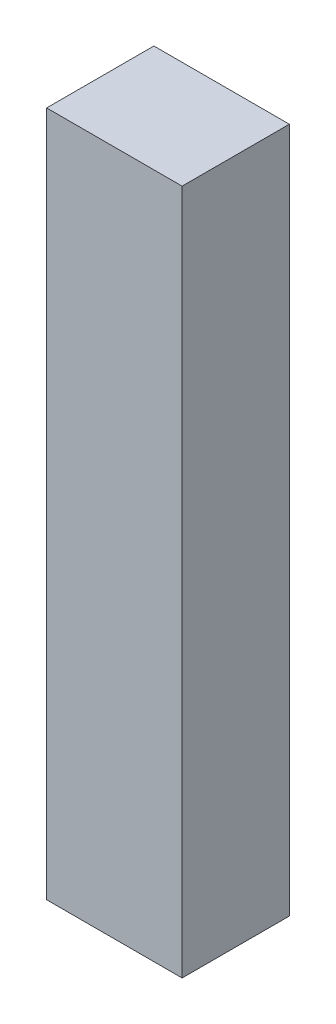
ISO-10303-21;
HEADER;
FILE_DESCRIPTION(('STEP AP214'),'2;1');
FILE_NAME('part.step','',(''),(''),'','','');
FILE_SCHEMA(('AUTOMOTIVE_DESIGN { 1 0 10303 214 1 1 1 1 }'));
ENDSEC;
DATA;
#1=APPLICATION_CONTEXT('core data for automotive mechanical design processes');
#2=APPLICATION_PROTOCOL_DEFINITION('international standard','automotive_design',2000,#1);
#3=PRODUCT_CONTEXT('',#1,'mechanical');
#4=PRODUCT('Part','Part','',(#3));
#5=PRODUCT_RELATED_PRODUCT_CATEGORY('part','',(#4));
#6=PRODUCT_DEFINITION_FORMATION('','',#4);
#7=PRODUCT_DEFINITION_CONTEXT('part definition',#1,'design');
#8=PRODUCT_DEFINITION('design','',#6,#7);
#9=PRODUCT_DEFINITION_SHAPE('','',#8);
#10=(LENGTH_UNIT() NAMED_UNIT(*) SI_UNIT(.MILLI.,.METRE.));
#11=(NAMED_UNIT(*) PLANE_ANGLE_UNIT() SI_UNIT($,.RADIAN.));
#12=(NAMED_UNIT(*) SI_UNIT($,.STERADIAN.) SOLID_ANGLE_UNIT());
#13=UNCERTAINTY_MEASURE_WITH_UNIT(LENGTH_MEASURE(1.E-05),#10,'distance_accuracy_value','');
#14=(GEOMETRIC_REPRESENTATION_CONTEXT(3) GLOBAL_UNCERTAINTY_ASSIGNED_CONTEXT((#13)) GLOBAL_UNIT_ASSIGNED_CONTEXT((#10,
#11,#12)) REPRESENTATION_CONTEXT('',''));
#15=CARTESIAN_POINT('',(0.,0.,0.));
#16=DIRECTION('',(0.,0.,1.));
#17=DIRECTION('',(1.,0.,0.));
#18=AXIS2_PLACEMENT_3D('',#15,#16,#17);
#19=CARTESIAN_POINT('',(0.3048,1.54305,0.4826));
#20=DIRECTION('',(0.,0.,-1.));
#21=DIRECTION('',(-1.,0.,0.));
#22=AXIS2_PLACEMENT_3D('',#19,#20,#21);
#23=PLANE('',#22);
#24=DIRECTION('',(0.,1.,0.));
#25=VECTOR('',#24,1.);
#26=CARTESIAN_POINT('',(-0.3048,1.54305,0.4826));
#27=LINE('',#26,#25);
#28=CARTESIAN_POINT('',(-0.3048,1.54305,0.4826));
#29=VERTEX_POINT('',#28);
#30=CARTESIAN_POINT('',(-0.3048,-1.54305,0.4826));
#31=VERTEX_POINT('',#30);
#32=EDGE_CURVE('E55',#29,#31,#27,.F.);
#33=ORIENTED_EDGE('',*,*,#32,.T.);
#34=DIRECTION('',(1.,0.,0.));
#35=VECTOR('',#34,1.);
#36=CARTESIAN_POINT('',(-0.3048,-1.54305,0.4826));
#37=LINE('',#36,#35);
#38=CARTESIAN_POINT('',(0.3048,-1.54305,0.4826));
#39=VERTEX_POINT('',#38);
#40=EDGE_CURVE('E58',#31,#39,#37,.T.);
#41=ORIENTED_EDGE('',*,*,#40,.T.);
#42=DIRECTION('',(0.,1.,0.));
#43=VECTOR('',#42,1.);
#44=CARTESIAN_POINT('',(0.3048,-1.54305,0.4826));
#45=LINE('',#44,#43);
#46=CARTESIAN_POINT('',(0.3048,1.54305,0.4826));
#47=VERTEX_POINT('',#46);
#48=EDGE_CURVE('E60',#39,#47,#45,.T.);
#49=ORIENTED_EDGE('',*,*,#48,.T.);
#50=DIRECTION('',(-1.,0.,0.));
#51=VECTOR('',#50,1.);
#52=CARTESIAN_POINT('',(0.3048,1.54305,0.4826));
#53=LINE('',#52,#51);
#54=EDGE_CURVE('E20',#29,#47,#53,.F.);
#55=ORIENTED_EDGE('',*,*,#54,.F.);
#56=EDGE_LOOP('',(#33,#41,#49,#55));
#57=FACE_BOUND('',#56,.T.);
#58=ADVANCED_FACE('F17',(#57),#23,.F.);
#59=CARTESIAN_POINT('',(0.3048,-1.54305,0.));
#60=DIRECTION('',(-1.,0.,0.));
#61=DIRECTION('',(0.,0.,1.));
#62=AXIS2_PLACEMENT_3D('',#59,#60,#61);
#63=PLANE('',#62);
#64=DIRECTION('',(0.,0.,-1.));
#65=VECTOR('',#64,1.);
#66=CARTESIAN_POINT('',(0.3048,1.54305,0.));
#67=LINE('',#66,#65);
#68=CARTESIAN_POINT('',(0.3048,1.54305,0.));
#69=VERTEX_POINT('',#68);
#70=EDGE_CURVE('E71',#69,#47,#67,.F.);
#71=ORIENTED_EDGE('',*,*,#70,.T.);
#72=ORIENTED_EDGE('',*,*,#48,.F.);
#73=DIRECTION('',(0.,0.,1.));
#74=VECTOR('',#73,1.);
#75=CARTESIAN_POINT('',(0.3048,-1.54305,0.));
#76=LINE('',#75,#74);
#77=CARTESIAN_POINT('',(0.3048,-1.54305,0.));
#78=VERTEX_POINT('',#77);
#79=EDGE_CURVE('E65',#39,#78,#76,.F.);
#80=ORIENTED_EDGE('',*,*,#79,.T.);
#81=DIRECTION('',(0.,1.,0.));
#82=VECTOR('',#81,1.);
#83=CARTESIAN_POINT('',(0.3048,1.54305,0.));
#84=LINE('',#83,#82);
#85=EDGE_CURVE('E83',#69,#78,#84,.F.);
#86=ORIENTED_EDGE('',*,*,#85,.F.);
#87=EDGE_LOOP('',(#71,#72,#80,#86));
#88=FACE_BOUND('',#87,.T.);
#89=ADVANCED_FACE('F68',(#88),#63,.F.);
#90=CARTESIAN_POINT('',(-0.3048,-1.54305,0.));
#91=DIRECTION('',(0.,1.,0.));
#92=DIRECTION('',(0.,0.,1.));
#93=AXIS2_PLACEMENT_3D('',#90,#91,#92);
#94=PLANE('',#93);
#95=ORIENTED_EDGE('',*,*,#79,.F.);
#96=ORIENTED_EDGE('',*,*,#40,.F.);
#97=DIRECTION('',(0.,0.,-1.));
#98=VECTOR('',#97,1.);
#99=CARTESIAN_POINT('',(-0.3048,-1.54305,0.));
#100=LINE('',#99,#98);
#101=CARTESIAN_POINT('',(-0.3048,-1.54305,0.));
#102=VERTEX_POINT('',#101);
#103=EDGE_CURVE('E77',#31,#102,#100,.T.);
#104=ORIENTED_EDGE('',*,*,#103,.T.);
#105=DIRECTION('',(-1.,0.,0.));
#106=VECTOR('',#105,1.);
#107=CARTESIAN_POINT('',(0.3048,-1.54305,0.));
#108=LINE('',#107,#106);
#109=EDGE_CURVE('E74',#78,#102,#108,.T.);
#110=ORIENTED_EDGE('',*,*,#109,.F.);
#111=EDGE_LOOP('',(#95,#96,#104,#110));
#112=FACE_BOUND('',#111,.T.);
#113=ADVANCED_FACE('F72',(#112),#94,.F.);
#114=CARTESIAN_POINT('',(-0.3048,1.54305,0.));
#115=DIRECTION('',(1.,0.,0.));
#116=DIRECTION('',(0.,0.,-1.));
#117=AXIS2_PLACEMENT_3D('',#114,#115,#116);
#118=PLANE('',#117);
#119=ORIENTED_EDGE('',*,*,#103,.F.);
#120=ORIENTED_EDGE('',*,*,#32,.F.);
#121=DIRECTION('',(0.,0.,-1.));
#122=VECTOR('',#121,1.);
#123=CARTESIAN_POINT('',(-0.3048,1.54305,0.));
#124=LINE('',#123,#122);
#125=CARTESIAN_POINT('',(-0.3048,1.54305,0.));
#126=VERTEX_POINT('',#125);
#127=EDGE_CURVE('E35',#29,#126,#124,.T.);
#128=ORIENTED_EDGE('',*,*,#127,.T.);
#129=DIRECTION('',(0.,1.,0.));
#130=VECTOR('',#129,1.);
#131=CARTESIAN_POINT('',(-0.3048,1.54305,0.));
#132=LINE('',#131,#130);
#133=EDGE_CURVE('E26',#102,#126,#132,.T.);
#134=ORIENTED_EDGE('',*,*,#133,.F.);
#135=EDGE_LOOP('',(#119,#120,#128,#134));
#136=FACE_BOUND('',#135,.T.);
#137=ADVANCED_FACE('F89',(#136),#118,.F.);
#138=CARTESIAN_POINT('',(0.3048,1.54305,0.));
#139=DIRECTION('',(0.,-1.,0.));
#140=DIRECTION('',(0.,0.,-1.));
#141=AXIS2_PLACEMENT_3D('',#138,#139,#140);
#142=PLANE('',#141);
#143=ORIENTED_EDGE('',*,*,#127,.F.);
#144=ORIENTED_EDGE('',*,*,#54,.T.);
#145=ORIENTED_EDGE('',*,*,#70,.F.);
#146=DIRECTION('',(-1.,0.,0.));
#147=VECTOR('',#146,1.);
#148=CARTESIAN_POINT('',(0.3048,1.54305,0.));
#149=LINE('',#148,#147);
#150=EDGE_CURVE('E11',#126,#69,#149,.F.);
#151=ORIENTED_EDGE('',*,*,#150,.F.);
#152=EDGE_LOOP('',(#143,#144,#145,#151));
#153=FACE_BOUND('',#152,.T.);
#154=ADVANCED_FACE('F91',(#153),#142,.F.);
#155=CARTESIAN_POINT('',(0.3048,1.54305,0.));
#156=DIRECTION('',(0.,0.,-1.));
#157=DIRECTION('',(-1.,0.,0.));
#158=AXIS2_PLACEMENT_3D('',#155,#156,#157);
#159=PLANE('',#158);
#160=ORIENTED_EDGE('',*,*,#133,.T.);
#161=ORIENTED_EDGE('',*,*,#150,.T.);
#162=ORIENTED_EDGE('',*,*,#85,.T.);
#163=ORIENTED_EDGE('',*,*,#109,.T.);
#164=EDGE_LOOP('',(#160,#161,#162,#163));
#165=FACE_BOUND('',#164,.T.);
#166=ADVANCED_FACE('F88',(#165),#159,.T.);
#167=CLOSED_SHELL('',(#58,#89,#113,#137,#154,#166));
#168=MANIFOLD_SOLID_BREP('B1',#167);
#169=ADVANCED_BREP_SHAPE_REPRESENTATION('',(#18,#168),#14);
#170=SHAPE_DEFINITION_REPRESENTATION(#9,#169);
ENDSEC;
END-ISO-10303-21;
